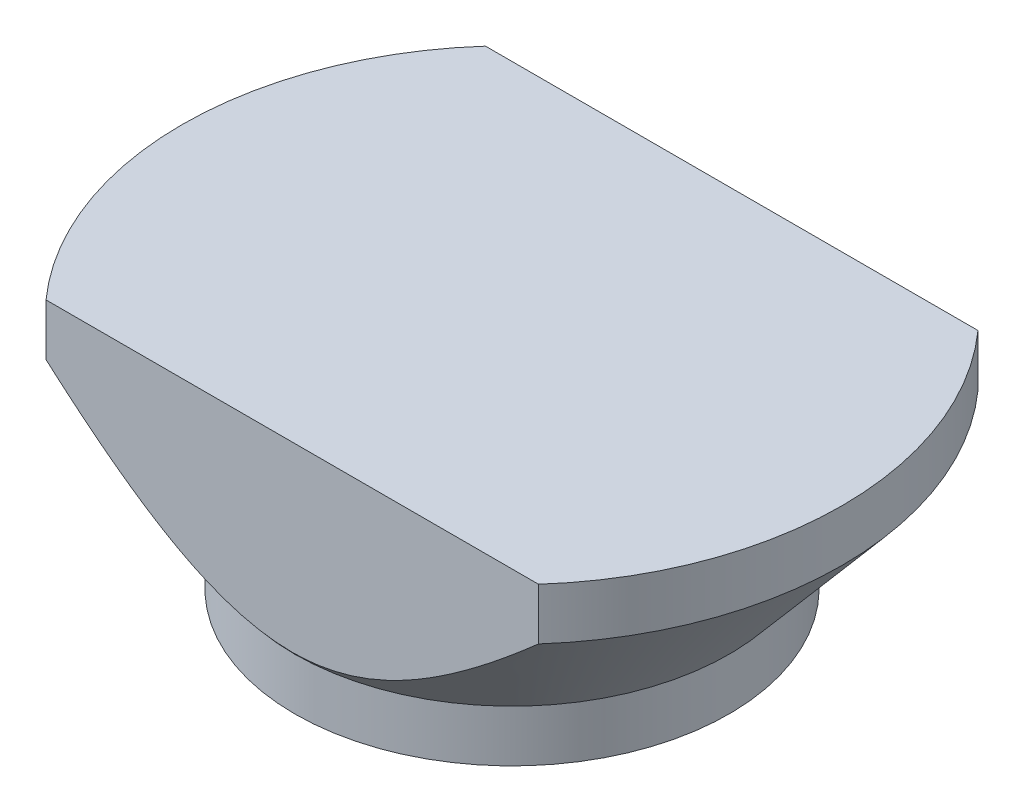
ISO-10303-21;
HEADER;
FILE_DESCRIPTION(('STEP AP214'),'2;1');
FILE_NAME('part.step','',(''),(''),'','','');
FILE_SCHEMA(('AUTOMOTIVE_DESIGN { 1 0 10303 214 1 1 1 1 }'));
ENDSEC;
DATA;
#1=APPLICATION_CONTEXT('core data for automotive mechanical design processes');
#2=APPLICATION_PROTOCOL_DEFINITION('international standard','automotive_design',2000,#1);
#3=PRODUCT_CONTEXT('',#1,'mechanical');
#4=PRODUCT('Part','Part','',(#3));
#5=PRODUCT_RELATED_PRODUCT_CATEGORY('part','',(#4));
#6=PRODUCT_DEFINITION_FORMATION('','',#4);
#7=PRODUCT_DEFINITION_CONTEXT('part definition',#1,'design');
#8=PRODUCT_DEFINITION('design','',#6,#7);
#9=PRODUCT_DEFINITION_SHAPE('','',#8);
#10=(LENGTH_UNIT() NAMED_UNIT(*) SI_UNIT(.MILLI.,.METRE.));
#11=(NAMED_UNIT(*) PLANE_ANGLE_UNIT() SI_UNIT($,.RADIAN.));
#12=(NAMED_UNIT(*) SI_UNIT($,.STERADIAN.) SOLID_ANGLE_UNIT());
#13=UNCERTAINTY_MEASURE_WITH_UNIT(LENGTH_MEASURE(1.E-05),#10,'distance_accuracy_value','');
#14=(GEOMETRIC_REPRESENTATION_CONTEXT(3) GLOBAL_UNCERTAINTY_ASSIGNED_CONTEXT((#13)) GLOBAL_UNIT_ASSIGNED_CONTEXT((#10,
#11,#12)) REPRESENTATION_CONTEXT('',''));
#15=CARTESIAN_POINT('',(0.,0.,0.));
#16=DIRECTION('',(0.,0.,1.));
#17=DIRECTION('',(1.,0.,0.));
#18=AXIS2_PLACEMENT_3D('',#15,#16,#17);
#19=CARTESIAN_POINT('',(0.,17.9,0.));
#20=DIRECTION('',(0.,1.,0.));
#21=DIRECTION('',(0.,0.,1.));
#22=AXIS2_PLACEMENT_3D('',#19,#20,#21);
#23=CONICAL_SURFACE('',#22,31.91519793,0.702248497920356);
#24=CARTESIAN_POINT('',(0.,5.,0.));
#25=DIRECTION('',(0.,1.,0.));
#26=DIRECTION('',(0.,0.,1.));
#27=AXIS2_PLACEMENT_3D('',#24,#25,#26);
#28=CIRCLE('',#27,21.);
#29=CARTESIAN_POINT('',(0.,5.,21.));
#30=VERTEX_POINT('',#29);
#31=EDGE_CURVE('E48',#30,#30,#28,.T.);
#32=ORIENTED_EDGE('',*,*,#31,.T.);
#33=EDGE_LOOP('',(#32));
#34=FACE_BOUND('',#33,.T.);
#35=CARTESIAN_POINT('',(0.,17.9,0.));
#36=DIRECTION('',(0.,1.,0.));
#37=DIRECTION('',(0.,0.,1.));
#38=AXIS2_PLACEMENT_3D('',#35,#36,#37);
#39=CIRCLE('',#38,31.91519793);
#40=CARTESIAN_POINT('',(-23.812126295,17.9,-21.2500000052246));
#41=VERTEX_POINT('',#40);
#42=CARTESIAN_POINT('',(-23.812126295,17.9,21.2500000052246));
#43=VERTEX_POINT('',#42);
#44=EDGE_CURVE('E101',#41,#43,#39,.T.);
#45=ORIENTED_EDGE('',*,*,#44,.F.);
#46=CARTESIAN_POINT('',(-70.5326921715194,67.2406442091488,-21.2500000052246));
#47=CARTESIAN_POINT('',(-69.8136814439279,66.4270170204652,-21.2500000052246));
#48=CARTESIAN_POINT('',(-69.0941602712144,65.6138409182486,-21.2500000052246));
#49=CARTESIAN_POINT('',(-67.6539941521017,63.9884841578586,-21.2500000052246));
#50=CARTESIAN_POINT('',(-66.9333492054459,63.1763034999126,-21.2500000052246));
#51=CARTESIAN_POINT('',(-64.7695583251981,60.7413765358604,-21.2500000052246));
#52=CARTESIAN_POINT('',(-63.3245728421887,59.1202639101,-21.2500000052246));
#53=CARTESIAN_POINT('',(-60.4273166300909,55.8818217401066,-21.2500000052246));
#54=CARTESIAN_POINT('',(-58.9750403420464,54.2644971658942,-21.2500000052246));
#55=CARTESIAN_POINT('',(-56.7911611949371,51.8434492704412,-21.2500000052246));
#56=CARTESIAN_POINT('',(-56.0622930187026,51.037259020803,-21.2500000052246));
#57=CARTESIAN_POINT('',(-54.6025149845126,49.4267239386222,-21.2500000052246));
#58=CARTESIAN_POINT('',(-53.8716051184849,48.6223791133987,-21.2500000052246));
#59=CARTESIAN_POINT('',(-51.6324513424281,46.1652233107148,-21.2500000052246));
#60=CARTESIAN_POINT('',(-50.1205367978739,44.5157494981213,-21.2500000052246));
#61=CARTESIAN_POINT('',(-47.8434791574464,42.0500307201742,-21.2500000052246));
#62=CARTESIAN_POINT('',(-47.082930257629,41.229541154379,-21.2500000052246));
#63=CARTESIAN_POINT('',(-45.5583316491484,39.5918219214244,-21.2500000052246));
#64=CARTESIAN_POINT('',(-44.7942819468293,38.7745922483623,-21.2500000052246));
#65=CARTESIAN_POINT('',(-43.2626883534287,37.144434950026,-21.2500000052246));
#66=CARTESIAN_POINT('',(-42.4951471235568,36.3315048255088,-21.2500000052246));
#67=CARTESIAN_POINT('',(-40.9554588053885,34.7100137069884,-21.2500000052246));
#68=CARTESIAN_POINT('',(-40.1833117113429,33.9014527184414,-21.2500000052246));
#69=CARTESIAN_POINT('',(-38.6337016610648,32.2894798818002,-21.2500000052246));
#70=CARTESIAN_POINT('',(-37.8562388520338,31.4860678923052,-21.2500000052246));
#71=CARTESIAN_POINT('',(-36.2950856217029,29.885322211813,-21.2500000052246));
#72=CARTESIAN_POINT('',(-35.5113952357437,29.0879884863727,-21.2500000052246));
#73=CARTESIAN_POINT('',(-33.8573611876799,27.4206218601967,-21.2500000052246));
#74=CARTESIAN_POINT('',(-32.9862416641563,26.5513573576413,-21.2500000052246));
#75=CARTESIAN_POINT('',(-31.2332554168588,24.8236822828105,-21.2500000052246));
#76=CARTESIAN_POINT('',(-30.3513884639996,23.9652719426931,-21.2500000052246));
#77=CARTESIAN_POINT('',(-28.5732156933996,22.2608116175026,-21.2500000052246));
#78=CARTESIAN_POINT('',(-27.6768902926199,21.4147819891829,-21.2500000052246));
#79=CARTESIAN_POINT('',(-26.3202162227955,20.1589464470413,-21.2500000052246));
#80=CARTESIAN_POINT('',(-25.8659694860698,19.7425440486393,-21.2500000052246));
#81=CARTESIAN_POINT('',(-24.9529138896553,18.9147750726836,-21.2500000052246));
#82=CARTESIAN_POINT('',(-24.4941050805211,18.5034084394383,-21.2500000052246));
#83=CARTESIAN_POINT('',(-23.5736239619146,17.6884418431081,-21.2500000052246));
#84=CARTESIAN_POINT('',(-23.1119765662181,17.2848137681552,-21.2500000052246));
#85=CARTESIAN_POINT('',(-22.1829832924503,16.4841568228529,-21.2500000052246));
#86=CARTESIAN_POINT('',(-21.7156373902041,16.0871279805165,-21.2500000052246));
#87=CARTESIAN_POINT('',(-20.7743784829548,15.3006215151485,-21.2500000052246));
#88=CARTESIAN_POINT('',(-20.3004634887438,14.9111462690601,-21.2500000052246));
#89=CARTESIAN_POINT('',(-19.3453772948491,14.141189678118,-21.2500000052246));
#90=CARTESIAN_POINT('',(-18.8642061701648,13.7607082404083,-21.2500000052246));
#91=CARTESIAN_POINT('',(-17.8947803159053,13.0112295140501,-21.2500000052246));
#92=CARTESIAN_POINT('',(-17.4065447836103,12.6422074494293,-21.2500000052246));
#93=CARTESIAN_POINT('',(-16.420787245852,11.916692552946,-21.2500000052246));
#94=CARTESIAN_POINT('',(-15.9232647820936,11.5602003419278,-21.2500000052246));
#95=CARTESIAN_POINT('',(-14.9180570267453,10.8624632492999,-21.2500000052246));
#96=CARTESIAN_POINT('',(-14.4103780806101,10.5212092531207,-21.2500000052246));
#97=CARTESIAN_POINT('',(-13.3833203875595,9.856859465786,-21.2500000052246));
#98=CARTESIAN_POINT('',(-12.8639435070866,9.53376080623884,-21.2500000052246));
#99=CARTESIAN_POINT('',(-11.9691552353523,9.00278414258129,-21.2500000052246));
#100=CARTESIAN_POINT('',(-11.5970655748677,8.78930990548444,-21.2500000052246));
#101=CARTESIAN_POINT('',(-10.8459934745979,8.37481071229154,-21.2500000052246));
#102=CARTESIAN_POINT('',(-10.4670109994204,8.17378582014238,-21.2500000052246));
#103=CARTESIAN_POINT('',(-9.70159748162092,7.7859604124517,-21.2500000052246));
#104=CARTESIAN_POINT('',(-9.31516353294104,7.59916559319599,-21.2500000052246));
#105=CARTESIAN_POINT('',(-8.53482143079404,7.24203863982487,-21.2500000052246));
#106=CARTESIAN_POINT('',(-8.14091334659132,7.07170635323669,-21.2500000052246));
#107=CARTESIAN_POINT('',(-6.95502967612492,6.59191239822377,-21.2500000052246));
#108=CARTESIAN_POINT('',(-6.15145748664934,6.30979530218947,-21.2500000052246));
#109=CARTESIAN_POINT('',(-4.92635893655344,5.95724745528624,-21.2500000052246));
#110=CARTESIAN_POINT('',(-4.51481021232454,5.85152077766928,-21.2500000052246));
#111=CARTESIAN_POINT('',(-3.68594562118901,5.66592888243448,-21.2500000052246));
#112=CARTESIAN_POINT('',(-3.26863087973158,5.58605869029973,-21.2500000052246));
#113=CARTESIAN_POINT('',(-2.29699572266022,5.4334873958766,-21.2500000052246));
#114=CARTESIAN_POINT('',(-1.74102367677771,5.37101394805714,-21.2500000052246));
#115=CARTESIAN_POINT('',(-0.625767950401072,5.29773093531943,-21.2500000052246));
#116=CARTESIAN_POINT('',(-0.0664849312586581,5.28691137968014,-21.2500000052246));
#117=CARTESIAN_POINT('',(1.05121772462413,5.31748868429387,-21.2500000052246));
#118=CARTESIAN_POINT('',(1.60963582718658,5.35894066570232,-21.2500000052246));
#119=CARTESIAN_POINT('',(2.72053108197161,5.49200990033789,-21.2500000052246));
#120=CARTESIAN_POINT('',(3.27300699975777,5.58363737940471,-21.2500000052246));
#121=CARTESIAN_POINT('',(4.16878954502423,5.77095296744119,-21.2500000052246));
#122=CARTESIAN_POINT('',(4.51503022651002,5.85302173610074,-21.2500000052246));
#123=CARTESIAN_POINT('',(5.20301983438238,6.0342669518937,-21.2500000052246));
#124=CARTESIAN_POINT('',(5.54476831867424,6.13344506945884,-21.2500000052246));
#125=CARTESIAN_POINT('',(6.56277163391441,6.45450714499896,-21.2500000052246));
#126=CARTESIAN_POINT('',(7.2317208190832,6.69990505838247,-21.2500000052246));
#127=CARTESIAN_POINT('',(8.2205596669441,7.10666752277826,-21.2500000052246));
#128=CARTESIAN_POINT('',(8.54852312138968,7.24909396248589,-21.2500000052246));
#129=CARTESIAN_POINT('',(9.19924689815784,7.54544596981658,-21.2500000052246));
#130=CARTESIAN_POINT('',(9.52200717964605,7.69937162763185,-21.2500000052246));
#131=CARTESIAN_POINT('',(10.1623089747182,8.01740443304841,-21.2500000052246));
#132=CARTESIAN_POINT('',(10.4798522428556,8.18150806516664,-21.2500000052246));
#133=CARTESIAN_POINT('',(11.110035334743,8.51882574560924,-21.2500000052246));
#134=CARTESIAN_POINT('',(11.4226753087363,8.69203951407648,-21.2500000052246));
#135=CARTESIAN_POINT('',(12.3642555718633,9.22990232813774,-21.2500000052246));
#136=CARTESIAN_POINT('',(12.985946300213,9.60728110296089,-21.2500000052246));
#137=CARTESIAN_POINT('',(14.2124648894967,10.3886355264042,-21.2500000052246));
#138=CARTESIAN_POINT('',(14.8172878148758,10.7926188457194,-21.2500000052246));
#139=CARTESIAN_POINT('',(16.0127922596179,11.6222424966159,-21.2500000052246));
#140=CARTESIAN_POINT('',(16.603458029097,12.0479054391297,-21.2500000052246));
#141=CARTESIAN_POINT('',(17.771929414795,12.9163487408589,-21.2500000052246));
#142=CARTESIAN_POINT('',(18.3497362252616,13.3591274999386,-21.2500000052246));
#143=CARTESIAN_POINT('',(19.4965396559668,14.2604475255739,-21.2500000052246));
#144=CARTESIAN_POINT('',(20.0654931418997,14.7190435184158,-21.2500000052246));
#145=CARTESIAN_POINT('',(21.1938020889165,15.6478883439278,-21.2500000052246));
#146=CARTESIAN_POINT('',(21.7531573656753,16.1181373999617,-21.2500000052246));
#147=CARTESIAN_POINT('',(22.8632404294357,17.0680795538126,-21.2500000052246));
#148=CARTESIAN_POINT('',(23.4139728018491,17.5477673033467,-21.2500000052246));
#149=CARTESIAN_POINT('',(24.5082059906366,18.5153001670568,-21.2500000052246));
#150=CARTESIAN_POINT('',(25.0517068624819,19.0031452185952,-21.2500000052246));
#151=CARTESIAN_POINT('',(26.1389476876473,19.9917221736367,-21.2500000052246));
#152=CARTESIAN_POINT('',(26.682610689344,20.4925386050684,-21.2500000052246));
#153=CARTESIAN_POINT('',(27.7642760589274,21.5002423378871,-21.2500000052246));
#154=CARTESIAN_POINT('',(28.3022784192051,22.0071296474325,-21.2500000052246));
#155=CARTESIAN_POINT('',(29.3733597928687,23.0261866780684,-21.2500000052246));
#156=CARTESIAN_POINT('',(29.9064382862502,23.5383569452651,-21.2500000052246));
#157=CARTESIAN_POINT('',(30.9681934764356,24.5672424978236,-21.2500000052246));
#158=CARTESIAN_POINT('',(31.4968701435286,25.0839578138148,-21.2500000052246));
#159=CARTESIAN_POINT('',(33.0745778445385,26.6375903417304,-21.2500000052246));
#160=CARTESIAN_POINT('',(34.1178065911485,27.6804023440173,-21.2500000052246));
#161=CARTESIAN_POINT('',(36.1918723644251,29.778166414171,-21.2500000052246));
#162=CARTESIAN_POINT('',(37.2227098606541,30.8331180190273,-21.2500000052246));
#163=CARTESIAN_POINT('',(38.953774189856,32.6214957385364,-21.2500000052246));
#164=CARTESIAN_POINT('',(39.6566425422163,33.3523688551825,-21.2500000052246));
#165=CARTESIAN_POINT('',(41.0582441797648,34.8180702380312,-21.2500000052246));
#166=CARTESIAN_POINT('',(41.7569774574687,35.5528985113877,-21.2500000052246));
#167=CARTESIAN_POINT('',(43.8477849215695,37.762525082702,-21.2500000052246));
#168=CARTESIAN_POINT('',(45.2344473657764,39.2424450554402,-21.2500000052246));
#169=CARTESIAN_POINT('',(47.9977086169935,42.2140033083726,-21.2500000052246));
#170=CARTESIAN_POINT('',(49.3742977511358,43.7056505662823,-21.2500000052246));
#171=CARTESIAN_POINT('',(52.118495638042,46.6971580901026,-21.2500000052246));
#172=CARTESIAN_POINT('',(53.4861044543896,48.1970182977245,-21.2500000052246));
#173=CARTESIAN_POINT('',(56.168363580721,51.1529393740763,-21.2500000052246));
#174=CARTESIAN_POINT('',(57.4832527615221,52.6087836573529,-21.2500000052246));
#175=CARTESIAN_POINT('',(60.1074452968179,55.5255032148405,-21.2500000052246));
#176=CARTESIAN_POINT('',(61.4167486354796,56.9863785032907,-21.2500000052246));
#177=CARTESIAN_POINT('',(64.0294037746311,59.9108358451756,-21.2500000052246));
#178=CARTESIAN_POINT('',(65.3327601888727,61.3744137788048,-21.2500000052246));
#179=CARTESIAN_POINT('',(67.9355164410953,64.3050653409826,-21.2500000052246));
#180=CARTESIAN_POINT('',(69.2349163073444,65.7721389444219,-21.2500000052246));
#181=CARTESIAN_POINT('',(70.5326921715194,67.2406442091488,-21.2500000052246));
#182=B_SPLINE_CURVE_WITH_KNOTS('',3,(#46,#47,#48,#49,#50,#51,#52,#53,#54,#55,#56,#57,#58,#59,
#60,#61,#62,#63,#64,#65,#66,#67,#68,#69,#70,#71,#72,#73,#74,#75,#76,#77,#78,#79,#80,#81,#82,#83,
#84,#85,#86,#87,#88,#89,#90,#91,#92,#93,#94,#95,#96,#97,#98,#99,#100,#101,#102,#103,#104,#105,
#106,#107,#108,#109,#110,#111,#112,#113,#114,#115,#116,#117,#118,#119,#120,#121,#122,#123,#124,
#125,#126,#127,#128,#129,#130,#131,#132,#133,#134,#135,#136,#137,#138,#139,#140,#141,#142,#143,
#144,#145,#146,#147,#148,#149,#150,#151,#152,#153,#154,#155,#156,#157,#158,#159,#160,#161,#162,
#163,#164,#165,#166,#167,#168,#169,#170,#171,#172,#173,#174,#175,#176,#177,#178,#179,#180,#181),
.UNSPECIFIED.,.F.,.F.,(4,2,2,2,2,2,2,2,2,2,2,2,2,2,2,2,2,2,2,2,2,2,2,2,2,2,2,2,2,2,2,2,2,2,2,2,
2,2,2,2,2,2,2,2,2,2,2,2,2,2,2,2,2,2,2,2,2,2,2,2,2,2,2,2,2,2,2,4),(0.,3.25740518828884,
6.51481112059522,13.0296977167446,19.5506906589469,22.8111664040108,26.0716550580896,
32.7842589893844,36.1405496882696,39.4968343072919,42.8508872260131,46.2049443322378,
49.5589089318563,52.9128545117587,56.6046892999362,60.2966029190354,63.9940259190985,
65.8426655534762,67.6912847248726,69.5308792010561,71.3704814841135,73.2106535509693,
75.0508066107866,76.8866562861339,78.7225967985113,80.5574240364003,82.3919605670881,
83.6786916287127,84.9654292991681,86.2526793721694,87.5399175217687,90.089337820082,
91.3633980968116,92.6372131118213,94.3132597824509,95.988982264668,97.6664733011382,
99.3443063400357,100.411384525007,101.478566950713,103.613125969811,104.685646020365,
105.758174483935,106.830334536137,107.902461671535,110.083308440659,112.264786773952,
114.448588845571,116.632187247771,118.824299408124,121.016453619057,123.207399546419,
125.398328657814,127.615813871989,129.833302066518,132.051021829864,134.268756550001,
138.693770138251,143.11861551003,146.160603763515,149.202597521122,155.28666873089,
161.375968607562,167.465225323325,173.350422659801,179.235636666837,185.115015586994,
190.99435240231),.UNSPECIFIED.);
#183=CARTESIAN_POINT('',(23.812126295,17.9,-21.2500000052246));
#184=VERTEX_POINT('',#183);
#185=EDGE_CURVE('E108',#41,#184,#182,.T.);
#186=ORIENTED_EDGE('',*,*,#185,.T.);
#187=CARTESIAN_POINT('',(23.812126295,17.9,21.2500000052246));
#188=VERTEX_POINT('',#187);
#189=EDGE_CURVE('E95',#188,#184,#39,.T.);
#190=ORIENTED_EDGE('',*,*,#189,.F.);
#191=CARTESIAN_POINT('',(70.5326921715194,67.2406442091488,21.2500000052246));
#192=CARTESIAN_POINT('',(69.8136814439279,66.4270170204652,21.2500000052246));
#193=CARTESIAN_POINT('',(69.0941602712144,65.6138409182486,21.2500000052246));
#194=CARTESIAN_POINT('',(67.6539941521017,63.9884841578586,21.2500000052246));
#195=CARTESIAN_POINT('',(66.9333492054459,63.1763034999126,21.2500000052246));
#196=CARTESIAN_POINT('',(64.7695583251981,60.7413765358604,21.2500000052246));
#197=CARTESIAN_POINT('',(63.3245728421887,59.1202639101,21.2500000052246));
#198=CARTESIAN_POINT('',(60.4273166300909,55.8818217401066,21.2500000052246));
#199=CARTESIAN_POINT('',(58.9750403420464,54.2644971658942,21.2500000052246));
#200=CARTESIAN_POINT('',(56.7911611949371,51.8434492704412,21.2500000052246));
#201=CARTESIAN_POINT('',(56.0622930187026,51.037259020803,21.2500000052246));
#202=CARTESIAN_POINT('',(54.6025149845126,49.4267239386222,21.2500000052246));
#203=CARTESIAN_POINT('',(53.8716051184849,48.6223791133987,21.2500000052246));
#204=CARTESIAN_POINT('',(51.6324513424281,46.1652233107148,21.2500000052246));
#205=CARTESIAN_POINT('',(50.1205367978739,44.5157494981213,21.2500000052246));
#206=CARTESIAN_POINT('',(47.8434791574464,42.0500307201742,21.2500000052246));
#207=CARTESIAN_POINT('',(47.082930257629,41.229541154379,21.2500000052246));
#208=CARTESIAN_POINT('',(45.5583316491484,39.5918219214244,21.2500000052246));
#209=CARTESIAN_POINT('',(44.7942819468293,38.7745922483623,21.2500000052246));
#210=CARTESIAN_POINT('',(43.2626883534287,37.144434950026,21.2500000052246));
#211=CARTESIAN_POINT('',(42.4951471235568,36.3315048255088,21.2500000052246));
#212=CARTESIAN_POINT('',(40.9554588053885,34.7100137069884,21.2500000052246));
#213=CARTESIAN_POINT('',(40.1833117113429,33.9014527184414,21.2500000052246));
#214=CARTESIAN_POINT('',(38.6337016610648,32.2894798818002,21.2500000052246));
#215=CARTESIAN_POINT('',(37.8562388520338,31.4860678923052,21.2500000052246));
#216=CARTESIAN_POINT('',(36.2950856217029,29.885322211813,21.2500000052246));
#217=CARTESIAN_POINT('',(35.5113952357437,29.0879884863727,21.2500000052246));
#218=CARTESIAN_POINT('',(33.8573611876799,27.4206218601967,21.2500000052246));
#219=CARTESIAN_POINT('',(32.9862416641563,26.5513573576413,21.2500000052246));
#220=CARTESIAN_POINT('',(31.2332554168588,24.8236822828105,21.2500000052246));
#221=CARTESIAN_POINT('',(30.3513884639996,23.9652719426931,21.2500000052246));
#222=CARTESIAN_POINT('',(28.5732156933996,22.2608116175026,21.2500000052246));
#223=CARTESIAN_POINT('',(27.6768902926199,21.4147819891829,21.2500000052246));
#224=CARTESIAN_POINT('',(26.3202162227955,20.1589464470413,21.2500000052246));
#225=CARTESIAN_POINT('',(25.8659694860698,19.7425440486393,21.2500000052246));
#226=CARTESIAN_POINT('',(24.9529138896553,18.9147750726836,21.2500000052246));
#227=CARTESIAN_POINT('',(24.4941050805211,18.5034084394383,21.2500000052246));
#228=CARTESIAN_POINT('',(23.5736239619146,17.6884418431081,21.2500000052246));
#229=CARTESIAN_POINT('',(23.1119765662181,17.2848137681552,21.2500000052246));
#230=CARTESIAN_POINT('',(22.1829832924503,16.4841568228529,21.2500000052246));
#231=CARTESIAN_POINT('',(21.7156373902041,16.0871279805165,21.2500000052246));
#232=CARTESIAN_POINT('',(20.7743784829548,15.3006215151485,21.2500000052246));
#233=CARTESIAN_POINT('',(20.3004634887438,14.9111462690601,21.2500000052246));
#234=CARTESIAN_POINT('',(19.3453772948491,14.141189678118,21.2500000052246));
#235=CARTESIAN_POINT('',(18.8642061701648,13.7607082404083,21.2500000052246));
#236=CARTESIAN_POINT('',(17.8947803159053,13.0112295140501,21.2500000052246));
#237=CARTESIAN_POINT('',(17.4065447836103,12.6422074494293,21.2500000052246));
#238=CARTESIAN_POINT('',(16.420787245852,11.916692552946,21.2500000052246));
#239=CARTESIAN_POINT('',(15.9232647820936,11.5602003419278,21.2500000052246));
#240=CARTESIAN_POINT('',(14.9180570267453,10.8624632492999,21.2500000052246));
#241=CARTESIAN_POINT('',(14.4103780806101,10.5212092531207,21.2500000052246));
#242=CARTESIAN_POINT('',(13.3833203875595,9.856859465786,21.2500000052246));
#243=CARTESIAN_POINT('',(12.8639435070866,9.53376080623884,21.2500000052246));
#244=CARTESIAN_POINT('',(11.9691552353523,9.00278414258129,21.2500000052246));
#245=CARTESIAN_POINT('',(11.5970655748677,8.78930990548444,21.2500000052246));
#246=CARTESIAN_POINT('',(10.8459934745979,8.37481071229154,21.2500000052246));
#247=CARTESIAN_POINT('',(10.4670109994204,8.17378582014238,21.2500000052246));
#248=CARTESIAN_POINT('',(9.70159748162092,7.7859604124517,21.2500000052246));
#249=CARTESIAN_POINT('',(9.31516353294104,7.59916559319599,21.2500000052246));
#250=CARTESIAN_POINT('',(8.53482143079404,7.24203863982487,21.2500000052246));
#251=CARTESIAN_POINT('',(8.14091334659132,7.07170635323669,21.2500000052246));
#252=CARTESIAN_POINT('',(6.95502967612492,6.59191239822377,21.2500000052246));
#253=CARTESIAN_POINT('',(6.15145748664934,6.30979530218947,21.2500000052246));
#254=CARTESIAN_POINT('',(4.92635893655344,5.95724745528624,21.2500000052246));
#255=CARTESIAN_POINT('',(4.51481021232454,5.85152077766928,21.2500000052246));
#256=CARTESIAN_POINT('',(3.68594562118901,5.66592888243448,21.2500000052246));
#257=CARTESIAN_POINT('',(3.26863087973158,5.58605869029973,21.2500000052246));
#258=CARTESIAN_POINT('',(2.29699572266022,5.4334873958766,21.2500000052246));
#259=CARTESIAN_POINT('',(1.74102367677771,5.37101394805714,21.2500000052246));
#260=CARTESIAN_POINT('',(0.625767950401072,5.29773093531943,21.2500000052246));
#261=CARTESIAN_POINT('',(0.0664849312586581,5.28691137968014,21.2500000052246));
#262=CARTESIAN_POINT('',(-1.05121772462413,5.31748868429387,21.2500000052246));
#263=CARTESIAN_POINT('',(-1.60963582718658,5.35894066570232,21.2500000052246));
#264=CARTESIAN_POINT('',(-2.72053108197161,5.49200990033789,21.2500000052246));
#265=CARTESIAN_POINT('',(-3.27300699975777,5.58363737940471,21.2500000052246));
#266=CARTESIAN_POINT('',(-4.16878954502423,5.77095296744119,21.2500000052246));
#267=CARTESIAN_POINT('',(-4.51503022651002,5.85302173610074,21.2500000052246));
#268=CARTESIAN_POINT('',(-5.20301983438238,6.0342669518937,21.2500000052246));
#269=CARTESIAN_POINT('',(-5.54476831867424,6.13344506945884,21.2500000052246));
#270=CARTESIAN_POINT('',(-6.56277163391441,6.45450714499896,21.2500000052246));
#271=CARTESIAN_POINT('',(-7.2317208190832,6.69990505838247,21.2500000052246));
#272=CARTESIAN_POINT('',(-8.2205596669441,7.10666752277826,21.2500000052246));
#273=CARTESIAN_POINT('',(-8.54852312138968,7.24909396248589,21.2500000052246));
#274=CARTESIAN_POINT('',(-9.19924689815784,7.54544596981658,21.2500000052246));
#275=CARTESIAN_POINT('',(-9.52200717964605,7.69937162763185,21.2500000052246));
#276=CARTESIAN_POINT('',(-10.1623089747182,8.01740443304841,21.2500000052246));
#277=CARTESIAN_POINT('',(-10.4798522428556,8.18150806516664,21.2500000052246));
#278=CARTESIAN_POINT('',(-11.110035334743,8.51882574560924,21.2500000052246));
#279=CARTESIAN_POINT('',(-11.4226753087363,8.69203951407648,21.2500000052246));
#280=CARTESIAN_POINT('',(-12.3642555718633,9.22990232813774,21.2500000052246));
#281=CARTESIAN_POINT('',(-12.985946300213,9.60728110296089,21.2500000052246));
#282=CARTESIAN_POINT('',(-14.2124648894967,10.3886355264042,21.2500000052246));
#283=CARTESIAN_POINT('',(-14.8172878148758,10.7926188457194,21.2500000052246));
#284=CARTESIAN_POINT('',(-16.0127922596179,11.6222424966159,21.2500000052246));
#285=CARTESIAN_POINT('',(-16.603458029097,12.0479054391297,21.2500000052246));
#286=CARTESIAN_POINT('',(-17.771929414795,12.9163487408589,21.2500000052246));
#287=CARTESIAN_POINT('',(-18.3497362252616,13.3591274999386,21.2500000052246));
#288=CARTESIAN_POINT('',(-19.4965396559668,14.2604475255739,21.2500000052246));
#289=CARTESIAN_POINT('',(-20.0654931418997,14.7190435184158,21.2500000052246));
#290=CARTESIAN_POINT('',(-21.1938020889165,15.6478883439278,21.2500000052246));
#291=CARTESIAN_POINT('',(-21.7531573656753,16.1181373999617,21.2500000052246));
#292=CARTESIAN_POINT('',(-22.8632404294357,17.0680795538126,21.2500000052246));
#293=CARTESIAN_POINT('',(-23.4139728018491,17.5477673033467,21.2500000052246));
#294=CARTESIAN_POINT('',(-24.5082059906366,18.5153001670568,21.2500000052246));
#295=CARTESIAN_POINT('',(-25.0517068624819,19.0031452185952,21.2500000052246));
#296=CARTESIAN_POINT('',(-26.1389476876473,19.9917221736367,21.2500000052246));
#297=CARTESIAN_POINT('',(-26.682610689344,20.4925386050684,21.2500000052246));
#298=CARTESIAN_POINT('',(-27.7642760589274,21.5002423378871,21.2500000052246));
#299=CARTESIAN_POINT('',(-28.3022784192051,22.0071296474325,21.2500000052246));
#300=CARTESIAN_POINT('',(-29.3733597928687,23.0261866780684,21.2500000052246));
#301=CARTESIAN_POINT('',(-29.9064382862502,23.5383569452651,21.2500000052246));
#302=CARTESIAN_POINT('',(-30.9681934764356,24.5672424978236,21.2500000052246));
#303=CARTESIAN_POINT('',(-31.4968701435286,25.0839578138148,21.2500000052246));
#304=CARTESIAN_POINT('',(-33.0745778445385,26.6375903417304,21.2500000052246));
#305=CARTESIAN_POINT('',(-34.1178065911485,27.6804023440173,21.2500000052246));
#306=CARTESIAN_POINT('',(-36.1918723644251,29.778166414171,21.2500000052246));
#307=CARTESIAN_POINT('',(-37.2227098606541,30.8331180190273,21.2500000052246));
#308=CARTESIAN_POINT('',(-38.953774189856,32.6214957385364,21.2500000052246));
#309=CARTESIAN_POINT('',(-39.6566425422163,33.3523688551825,21.2500000052246));
#310=CARTESIAN_POINT('',(-41.0582441797648,34.8180702380312,21.2500000052246));
#311=CARTESIAN_POINT('',(-41.7569774574687,35.5528985113877,21.2500000052246));
#312=CARTESIAN_POINT('',(-43.8477849215695,37.762525082702,21.2500000052246));
#313=CARTESIAN_POINT('',(-45.2344473657764,39.2424450554402,21.2500000052246));
#314=CARTESIAN_POINT('',(-47.9977086169935,42.2140033083726,21.2500000052246));
#315=CARTESIAN_POINT('',(-49.3742977511358,43.7056505662823,21.2500000052246));
#316=CARTESIAN_POINT('',(-52.118495638042,46.6971580901026,21.2500000052246));
#317=CARTESIAN_POINT('',(-53.4861044543896,48.1970182977245,21.2500000052246));
#318=CARTESIAN_POINT('',(-56.168363580721,51.1529393740763,21.2500000052246));
#319=CARTESIAN_POINT('',(-57.4832527615221,52.6087836573529,21.2500000052246));
#320=CARTESIAN_POINT('',(-60.1074452968179,55.5255032148405,21.2500000052246));
#321=CARTESIAN_POINT('',(-61.4167486354796,56.9863785032907,21.2500000052246));
#322=CARTESIAN_POINT('',(-64.0294037746311,59.9108358451756,21.2500000052246));
#323=CARTESIAN_POINT('',(-65.3327601888727,61.3744137788048,21.2500000052246));
#324=CARTESIAN_POINT('',(-67.9355164410953,64.3050653409826,21.2500000052246));
#325=CARTESIAN_POINT('',(-69.2349163073444,65.7721389444219,21.2500000052246));
#326=CARTESIAN_POINT('',(-70.5326921715194,67.2406442091488,21.2500000052246));
#327=B_SPLINE_CURVE_WITH_KNOTS('',3,(#191,#192,#193,#194,#195,#196,#197,#198,#199,#200,#201,
#202,#203,#204,#205,#206,#207,#208,#209,#210,#211,#212,#213,#214,#215,#216,#217,#218,#219,#220,
#221,#222,#223,#224,#225,#226,#227,#228,#229,#230,#231,#232,#233,#234,#235,#236,#237,#238,#239,
#240,#241,#242,#243,#244,#245,#246,#247,#248,#249,#250,#251,#252,#253,#254,#255,#256,#257,#258,
#259,#260,#261,#262,#263,#264,#265,#266,#267,#268,#269,#270,#271,#272,#273,#274,#275,#276,#277,
#278,#279,#280,#281,#282,#283,#284,#285,#286,#287,#288,#289,#290,#291,#292,#293,#294,#295,#296,
#297,#298,#299,#300,#301,#302,#303,#304,#305,#306,#307,#308,#309,#310,#311,#312,#313,#314,#315,
#316,#317,#318,#319,#320,#321,#322,#323,#324,#325,#326),.UNSPECIFIED.,.F.,.F.,(4,2,2,2,2,2,2,2,
2,2,2,2,2,2,2,2,2,2,2,2,2,2,2,2,2,2,2,2,2,2,2,2,2,2,2,2,2,2,2,2,2,2,2,2,2,2,2,2,2,2,2,2,2,2,2,2,
2,2,2,2,2,2,2,2,2,2,2,4),(0.,3.25740518828884,6.51481112059522,13.0296977167446,
19.5506906589469,22.8111664040108,26.0716550580896,32.7842589893844,36.1405496882696,
39.4968343072919,42.8508872260131,46.2049443322378,49.5589089318563,52.9128545117587,
56.6046892999362,60.2966029190354,63.9940259190985,65.8426655534762,67.6912847248726,
69.5308792010561,71.3704814841135,73.2106535509693,75.0508066107866,76.8866562861339,
78.7225967985113,80.5574240364003,82.3919605670881,83.6786916287127,84.9654292991681,
86.2526793721694,87.5399175217687,90.089337820082,91.3633980968116,92.6372131118213,
94.3132597824509,95.988982264668,97.6664733011382,99.3443063400357,100.411384525007,
101.478566950713,103.613125969811,104.685646020365,105.758174483935,106.830334536137,
107.902461671535,110.083308440659,112.264786773952,114.448588845571,116.632187247771,
118.824299408124,121.016453619057,123.207399546419,125.398328657814,127.615813871989,
129.833302066518,132.051021829864,134.268756550001,138.693770138251,143.11861551003,
146.160603763515,149.202597521122,155.28666873089,161.375968607562,167.465225323325,
173.350422659801,179.235636666837,185.115015586994,190.99435240231),.UNSPECIFIED.);
#328=EDGE_CURVE('E144',#188,#43,#327,.T.);
#329=ORIENTED_EDGE('',*,*,#328,.T.);
#330=EDGE_LOOP('',(#45,#186,#190,#329));
#331=FACE_BOUND('',#330,.T.);
#332=ADVANCED_FACE('F39',(#34,#331),#23,.T.);
#333=CARTESIAN_POINT('',(0.,22.9,0.));
#334=DIRECTION('',(0.,1.,0.));
#335=DIRECTION('',(0.,0.,1.));
#336=AXIS2_PLACEMENT_3D('',#333,#334,#335);
#337=CYLINDRICAL_SURFACE('',#336,31.91519793);
#338=CARTESIAN_POINT('',(0.,22.9,0.));
#339=DIRECTION('',(0.,1.,0.));
#340=DIRECTION('',(0.,0.,1.));
#341=AXIS2_PLACEMENT_3D('',#338,#339,#340);
#342=CIRCLE('',#341,31.91519793);
#343=CARTESIAN_POINT('',(-23.812126295,22.9,-21.2500000052246));
#344=VERTEX_POINT('',#343);
#345=CARTESIAN_POINT('',(-23.812126295,22.9,21.2500000052246));
#346=VERTEX_POINT('',#345);
#347=EDGE_CURVE('E102',#344,#346,#342,.T.);
#348=ORIENTED_EDGE('',*,*,#347,.F.);
#349=DIRECTION('',(0.,-1.,0.));
#350=VECTOR('',#349,1.);
#351=CARTESIAN_POINT('',(-23.812126295,22.9,-21.2500000052246));
#352=LINE('',#351,#350);
#353=EDGE_CURVE('E55',#344,#41,#352,.T.);
#354=ORIENTED_EDGE('',*,*,#353,.T.);
#355=ORIENTED_EDGE('',*,*,#44,.T.);
#356=DIRECTION('',(0.,-1.,0.));
#357=VECTOR('',#356,1.);
#358=CARTESIAN_POINT('',(-23.812126295,22.9,21.2500000052246));
#359=LINE('',#358,#357);
#360=EDGE_CURVE('E203',#346,#43,#359,.T.);
#361=ORIENTED_EDGE('',*,*,#360,.F.);
#362=EDGE_LOOP('',(#348,#354,#355,#361));
#363=FACE_BOUND('',#362,.T.);
#364=ADVANCED_FACE('F135',(#363),#337,.T.);
#365=ORIENTED_EDGE('',*,*,#189,.T.);
#366=DIRECTION('',(0.,-1.,0.));
#367=VECTOR('',#366,1.);
#368=CARTESIAN_POINT('',(23.812126295,22.9,-21.2500000052246));
#369=LINE('',#368,#367);
#370=CARTESIAN_POINT('',(23.812126295,22.9,-21.2500000052246));
#371=VERTEX_POINT('',#370);
#372=EDGE_CURVE('E81',#371,#184,#369,.T.);
#373=ORIENTED_EDGE('',*,*,#372,.F.);
#374=CARTESIAN_POINT('',(23.812126295,22.9,21.2500000052246));
#375=VERTEX_POINT('',#374);
#376=EDGE_CURVE('E93',#375,#371,#342,.T.);
#377=ORIENTED_EDGE('',*,*,#376,.F.);
#378=DIRECTION('',(0.,-1.,0.));
#379=VECTOR('',#378,1.);
#380=CARTESIAN_POINT('',(23.812126295,22.9,21.2500000052246));
#381=LINE('',#380,#379);
#382=EDGE_CURVE('E63',#375,#188,#381,.T.);
#383=ORIENTED_EDGE('',*,*,#382,.T.);
#384=EDGE_LOOP('',(#365,#373,#377,#383));
#385=FACE_BOUND('',#384,.T.);
#386=ADVANCED_FACE('F92',(#385),#337,.T.);
#387=CARTESIAN_POINT('',(-31.91519793,22.9,0.));
#388=DIRECTION('',(0.,1.,0.));
#389=DIRECTION('',(0.,0.,1.));
#390=AXIS2_PLACEMENT_3D('',#387,#388,#389);
#391=PLANE('',#390);
#392=ORIENTED_EDGE('',*,*,#376,.T.);
#393=DIRECTION('',(1.,0.,0.));
#394=VECTOR('',#393,1.);
#395=CARTESIAN_POINT('',(-23.812126295,22.9,-21.2500000052246));
#396=LINE('',#395,#394);
#397=EDGE_CURVE('E78',#344,#371,#396,.T.);
#398=ORIENTED_EDGE('',*,*,#397,.F.);
#399=ORIENTED_EDGE('',*,*,#347,.T.);
#400=DIRECTION('',(-1.,0.,0.));
#401=VECTOR('',#400,1.);
#402=CARTESIAN_POINT('',(-23.812126295,22.9,21.2500000052246));
#403=LINE('',#402,#401);
#404=EDGE_CURVE('E99',#375,#346,#403,.T.);
#405=ORIENTED_EDGE('',*,*,#404,.F.);
#406=EDGE_LOOP('',(#392,#398,#399,#405));
#407=FACE_BOUND('',#406,.T.);
#408=ADVANCED_FACE('F98',(#407),#391,.T.);
#409=CARTESIAN_POINT('',(0.,0.,0.));
#410=DIRECTION('',(0.,-1.,0.));
#411=DIRECTION('',(0.,0.,-1.));
#412=AXIS2_PLACEMENT_3D('',#409,#410,#411);
#413=PLANE('',#412);
#414=CARTESIAN_POINT('',(0.,0.,0.));
#415=DIRECTION('',(0.,1.,0.));
#416=DIRECTION('',(0.,0.,1.));
#417=AXIS2_PLACEMENT_3D('',#414,#415,#416);
#418=CIRCLE('',#417,21.);
#419=CARTESIAN_POINT('',(0.,0.,21.));
#420=VERTEX_POINT('',#419);
#421=EDGE_CURVE('E11',#420,#420,#418,.T.);
#422=ORIENTED_EDGE('',*,*,#421,.F.);
#423=EDGE_LOOP('',(#422));
#424=FACE_BOUND('',#423,.T.);
#425=ADVANCED_FACE('F41',(#424),#413,.T.);
#426=CARTESIAN_POINT('',(0.,22.9,0.));
#427=DIRECTION('',(0.,1.,0.));
#428=DIRECTION('',(0.,0.,1.));
#429=AXIS2_PLACEMENT_3D('',#426,#427,#428);
#430=CYLINDRICAL_SURFACE('',#429,21.);
#431=ORIENTED_EDGE('',*,*,#421,.T.);
#432=EDGE_LOOP('',(#431));
#433=FACE_BOUND('',#432,.T.);
#434=ORIENTED_EDGE('',*,*,#31,.F.);
#435=EDGE_LOOP('',(#434));
#436=FACE_BOUND('',#435,.T.);
#437=ADVANCED_FACE('F124',(#433,#436),#430,.T.);
#438=CARTESIAN_POINT('',(-23.812126295,22.9,21.2500000052246));
#439=DIRECTION('',(0.,0.,1.));
#440=DIRECTION('',(1.,0.,0.));
#441=AXIS2_PLACEMENT_3D('',#438,#439,#440);
#442=PLANE('',#441);
#443=ORIENTED_EDGE('',*,*,#382,.F.);
#444=ORIENTED_EDGE('',*,*,#404,.T.);
#445=ORIENTED_EDGE('',*,*,#360,.T.);
#446=ORIENTED_EDGE('',*,*,#328,.F.);
#447=EDGE_LOOP('',(#443,#444,#445,#446));
#448=FACE_BOUND('',#447,.T.);
#449=ADVANCED_FACE('F126',(#448),#442,.T.);
#450=CARTESIAN_POINT('',(-23.812126295,22.9,-21.2500000052246));
#451=DIRECTION('',(0.,0.,-1.));
#452=DIRECTION('',(-1.,0.,0.));
#453=AXIS2_PLACEMENT_3D('',#450,#451,#452);
#454=PLANE('',#453);
#455=ORIENTED_EDGE('',*,*,#353,.F.);
#456=ORIENTED_EDGE('',*,*,#397,.T.);
#457=ORIENTED_EDGE('',*,*,#372,.T.);
#458=ORIENTED_EDGE('',*,*,#185,.F.);
#459=EDGE_LOOP('',(#455,#456,#457,#458));
#460=FACE_BOUND('',#459,.T.);
#461=ADVANCED_FACE('F80',(#460),#454,.T.);
#462=CLOSED_SHELL('',(#332,#364,#386,#408,#425,#437,#449,#461));
#463=MANIFOLD_SOLID_BREP('B2',#462);
#464=ADVANCED_BREP_SHAPE_REPRESENTATION('',(#18,#463),#14);
#465=SHAPE_DEFINITION_REPRESENTATION(#9,#464);
ENDSEC;
END-ISO-10303-21;
